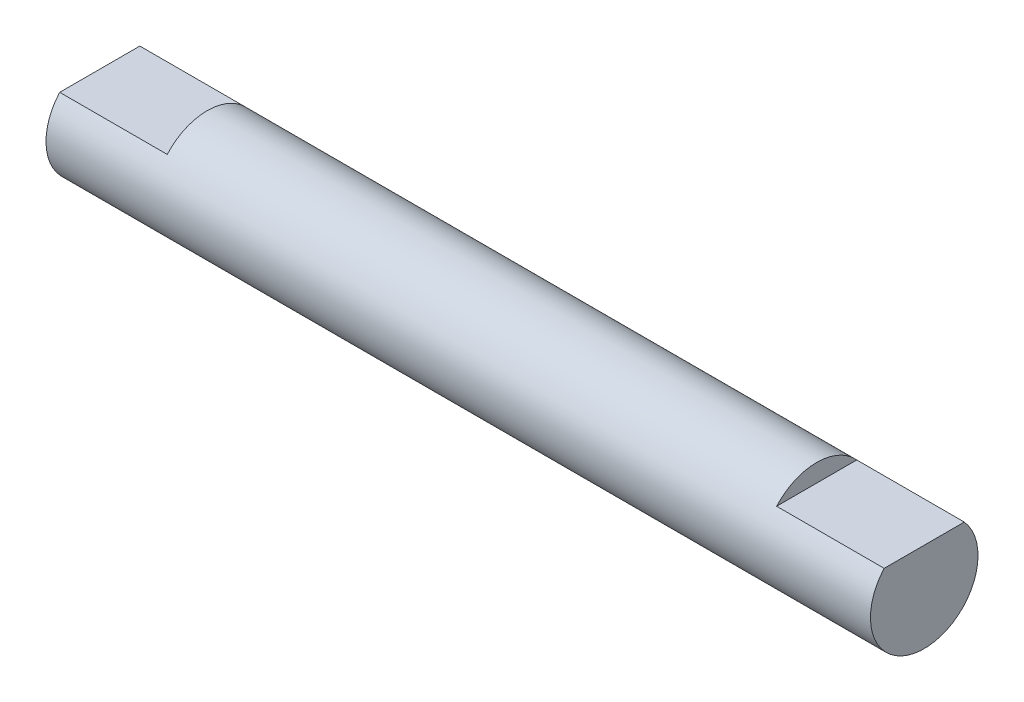
ISO-10303-21;
HEADER;
FILE_DESCRIPTION(('STEP AP214'),'2;1');
FILE_NAME('part.step','',(''),(''),'','','');
FILE_SCHEMA(('AUTOMOTIVE_DESIGN { 1 0 10303 214 1 1 1 1 }'));
ENDSEC;
DATA;
#1=APPLICATION_CONTEXT('core data for automotive mechanical design processes');
#2=APPLICATION_PROTOCOL_DEFINITION('international standard','automotive_design',2000,#1);
#3=PRODUCT_CONTEXT('',#1,'mechanical');
#4=PRODUCT('Part','Part','',(#3));
#5=PRODUCT_RELATED_PRODUCT_CATEGORY('part','',(#4));
#6=PRODUCT_DEFINITION_FORMATION('','',#4);
#7=PRODUCT_DEFINITION_CONTEXT('part definition',#1,'design');
#8=PRODUCT_DEFINITION('design','',#6,#7);
#9=PRODUCT_DEFINITION_SHAPE('','',#8);
#10=(LENGTH_UNIT() NAMED_UNIT(*) SI_UNIT(.MILLI.,.METRE.));
#11=(NAMED_UNIT(*) PLANE_ANGLE_UNIT() SI_UNIT($,.RADIAN.));
#12=(NAMED_UNIT(*) SI_UNIT($,.STERADIAN.) SOLID_ANGLE_UNIT());
#13=UNCERTAINTY_MEASURE_WITH_UNIT(LENGTH_MEASURE(1.E-05),#10,'distance_accuracy_value','');
#14=(GEOMETRIC_REPRESENTATION_CONTEXT(3) GLOBAL_UNCERTAINTY_ASSIGNED_CONTEXT((#13)) GLOBAL_UNIT_ASSIGNED_CONTEXT((#10,
#11,#12)) REPRESENTATION_CONTEXT('',''));
#15=CARTESIAN_POINT('',(0.,0.,0.));
#16=DIRECTION('',(0.,0.,1.));
#17=DIRECTION('',(1.,0.,0.));
#18=AXIS2_PLACEMENT_3D('',#15,#16,#17);
#19=CARTESIAN_POINT('',(0.,-2.99999999999999,0.));
#20=DIRECTION('',(-1.,0.,0.));
#21=DIRECTION('',(0.,0.,1.));
#22=AXIS2_PLACEMENT_3D('',#19,#20,#21);
#23=PLANE('',#22);
#24=DIRECTION('',(0.,0.,1.));
#25=VECTOR('',#24,1.);
#26=CARTESIAN_POINT('',(0.,2.,-2.23606797749979));
#27=LINE('',#26,#25);
#28=CARTESIAN_POINT('',(0.,2.,-2.23606797749979));
#29=VERTEX_POINT('',#28);
#30=CARTESIAN_POINT('',(0.,2.,2.23606797749979));
#31=VERTEX_POINT('',#30);
#32=EDGE_CURVE('E82',#29,#31,#27,.T.);
#33=ORIENTED_EDGE('',*,*,#32,.F.);
#34=CARTESIAN_POINT('',(0.,0.,0.));
#35=DIRECTION('',(-1.,0.,0.));
#36=DIRECTION('',(0.,0.,1.));
#37=AXIS2_PLACEMENT_3D('',#34,#35,#36);
#38=CIRCLE('',#37,2.99999999999999);
#39=EDGE_CURVE('E46',#29,#31,#38,.T.);
#40=ORIENTED_EDGE('',*,*,#39,.T.);
#41=EDGE_LOOP('',(#33,#40));
#42=FACE_BOUND('',#41,.T.);
#43=ADVANCED_FACE('F39',(#42),#23,.T.);
#44=CARTESIAN_POINT('',(46.,0.,0.));
#45=DIRECTION('',(1.,0.,0.));
#46=DIRECTION('',(0.,0.,-1.));
#47=AXIS2_PLACEMENT_3D('',#44,#45,#46);
#48=PLANE('',#47);
#49=DIRECTION('',(0.,0.,-1.));
#50=VECTOR('',#49,1.);
#51=CARTESIAN_POINT('',(46.,2.,2.23606797749979));
#52=LINE('',#51,#50);
#53=CARTESIAN_POINT('',(46.,2.,2.23606797749979));
#54=VERTEX_POINT('',#53);
#55=CARTESIAN_POINT('',(46.,2.,-2.23606797749979));
#56=VERTEX_POINT('',#55);
#57=EDGE_CURVE('E95',#54,#56,#52,.T.);
#58=ORIENTED_EDGE('',*,*,#57,.F.);
#59=CARTESIAN_POINT('',(46.,0.,0.));
#60=DIRECTION('',(-1.,0.,0.));
#61=DIRECTION('',(0.,0.,1.));
#62=AXIS2_PLACEMENT_3D('',#59,#60,#61);
#63=CIRCLE('',#62,3.);
#64=EDGE_CURVE('E11',#56,#54,#63,.T.);
#65=ORIENTED_EDGE('',*,*,#64,.F.);
#66=EDGE_LOOP('',(#58,#65));
#67=FACE_BOUND('',#66,.T.);
#68=ADVANCED_FACE('F109',(#67),#48,.T.);
#69=CARTESIAN_POINT('',(0.,0.,0.));
#70=DIRECTION('',(-1.,0.,0.));
#71=DIRECTION('',(0.,0.,1.));
#72=AXIS2_PLACEMENT_3D('',#69,#70,#71);
#73=CYLINDRICAL_SURFACE('',#72,3.);
#74=DIRECTION('',(-1.,0.,0.));
#75=VECTOR('',#74,1.);
#76=CARTESIAN_POINT('',(6.,2.,2.23606797749979));
#77=LINE('',#76,#75);
#78=CARTESIAN_POINT('',(6.,2.,2.23606797749979));
#79=VERTEX_POINT('',#78);
#80=EDGE_CURVE('E88',#79,#31,#77,.T.);
#81=ORIENTED_EDGE('',*,*,#80,.T.);
#82=ORIENTED_EDGE('',*,*,#39,.F.);
#83=DIRECTION('',(-1.,0.,0.));
#84=VECTOR('',#83,1.);
#85=CARTESIAN_POINT('',(6.,2.,-2.23606797749979));
#86=LINE('',#85,#84);
#87=CARTESIAN_POINT('',(6.,2.,-2.23606797749979));
#88=VERTEX_POINT('',#87);
#89=EDGE_CURVE('E86',#88,#29,#86,.T.);
#90=ORIENTED_EDGE('',*,*,#89,.F.);
#91=CARTESIAN_POINT('',(6.,0.,0.));
#92=DIRECTION('',(-1.,0.,0.));
#93=DIRECTION('',(0.,0.,1.));
#94=AXIS2_PLACEMENT_3D('',#91,#92,#93);
#95=CIRCLE('',#94,3.);
#96=EDGE_CURVE('E77',#79,#88,#95,.T.);
#97=ORIENTED_EDGE('',*,*,#96,.F.);
#98=EDGE_LOOP('',(#81,#82,#90,#97));
#99=FACE_BOUND('',#98,.T.);
#100=DIRECTION('',(1.,0.,0.));
#101=VECTOR('',#100,1.);
#102=CARTESIAN_POINT('',(40.,2.,2.23606797749979));
#103=LINE('',#102,#101);
#104=CARTESIAN_POINT('',(40.,2.,2.23606797749979));
#105=VERTEX_POINT('',#104);
#106=EDGE_CURVE('E102',#105,#54,#103,.T.);
#107=ORIENTED_EDGE('',*,*,#106,.F.);
#108=CARTESIAN_POINT('',(40.,0.,0.));
#109=DIRECTION('',(1.,0.,0.));
#110=DIRECTION('',(0.,0.,-1.));
#111=AXIS2_PLACEMENT_3D('',#108,#109,#110);
#112=CIRCLE('',#111,3.);
#113=CARTESIAN_POINT('',(40.,2.,-2.23606797749979));
#114=VERTEX_POINT('',#113);
#115=EDGE_CURVE('E99',#114,#105,#112,.T.);
#116=ORIENTED_EDGE('',*,*,#115,.F.);
#117=DIRECTION('',(1.,0.,0.));
#118=VECTOR('',#117,1.);
#119=CARTESIAN_POINT('',(40.,2.,-2.23606797749979));
#120=LINE('',#119,#118);
#121=EDGE_CURVE('E104',#114,#56,#120,.T.);
#122=ORIENTED_EDGE('',*,*,#121,.T.);
#123=ORIENTED_EDGE('',*,*,#64,.T.);
#124=EDGE_LOOP('',(#107,#116,#122,#123));
#125=FACE_BOUND('',#124,.T.);
#126=ADVANCED_FACE('F91',(#99,#125),#73,.T.);
#127=CARTESIAN_POINT('',(40.,2.,2.23606797749979));
#128=DIRECTION('',(0.,-1.,0.));
#129=DIRECTION('',(0.,0.,-1.));
#130=AXIS2_PLACEMENT_3D('',#127,#128,#129);
#131=PLANE('',#130);
#132=ORIENTED_EDGE('',*,*,#57,.T.);
#133=ORIENTED_EDGE('',*,*,#121,.F.);
#134=DIRECTION('',(0.,0.,-1.));
#135=VECTOR('',#134,1.);
#136=CARTESIAN_POINT('',(40.,2.,2.23606797749979));
#137=LINE('',#136,#135);
#138=EDGE_CURVE('E59',#105,#114,#137,.T.);
#139=ORIENTED_EDGE('',*,*,#138,.F.);
#140=ORIENTED_EDGE('',*,*,#106,.T.);
#141=EDGE_LOOP('',(#132,#133,#139,#140));
#142=FACE_BOUND('',#141,.T.);
#143=ADVANCED_FACE('F119',(#142),#131,.F.);
#144=CARTESIAN_POINT('',(40.,0.,0.));
#145=DIRECTION('',(1.,0.,0.));
#146=DIRECTION('',(0.,0.,-1.));
#147=AXIS2_PLACEMENT_3D('',#144,#145,#146);
#148=PLANE('',#147);
#149=ORIENTED_EDGE('',*,*,#115,.T.);
#150=ORIENTED_EDGE('',*,*,#138,.T.);
#151=EDGE_LOOP('',(#149,#150));
#152=FACE_BOUND('',#151,.T.);
#153=ADVANCED_FACE('F124',(#152),#148,.T.);
#154=CARTESIAN_POINT('',(6.,2.,-2.23606797749979));
#155=DIRECTION('',(0.,-1.,0.));
#156=DIRECTION('',(0.,0.,-1.));
#157=AXIS2_PLACEMENT_3D('',#154,#155,#156);
#158=PLANE('',#157);
#159=ORIENTED_EDGE('',*,*,#32,.T.);
#160=ORIENTED_EDGE('',*,*,#80,.F.);
#161=DIRECTION('',(0.,0.,1.));
#162=VECTOR('',#161,1.);
#163=CARTESIAN_POINT('',(6.,2.,-2.23606797749979));
#164=LINE('',#163,#162);
#165=EDGE_CURVE('E52',#88,#79,#164,.T.);
#166=ORIENTED_EDGE('',*,*,#165,.F.);
#167=ORIENTED_EDGE('',*,*,#89,.T.);
#168=EDGE_LOOP('',(#159,#160,#166,#167));
#169=FACE_BOUND('',#168,.T.);
#170=ADVANCED_FACE('F85',(#169),#158,.F.);
#171=CARTESIAN_POINT('',(6.,0.,0.));
#172=DIRECTION('',(-1.,0.,0.));
#173=DIRECTION('',(0.,0.,1.));
#174=AXIS2_PLACEMENT_3D('',#171,#172,#173);
#175=PLANE('',#174);
#176=ORIENTED_EDGE('',*,*,#96,.T.);
#177=ORIENTED_EDGE('',*,*,#165,.T.);
#178=EDGE_LOOP('',(#176,#177));
#179=FACE_BOUND('',#178,.T.);
#180=ADVANCED_FACE('F78',(#179),#175,.T.);
#181=CLOSED_SHELL('',(#43,#68,#126,#143,#153,#170,#180));
#182=MANIFOLD_SOLID_BREP('B2',#181);
#183=ADVANCED_BREP_SHAPE_REPRESENTATION('',(#18,#182),#14);
#184=SHAPE_DEFINITION_REPRESENTATION(#9,#183);
ENDSEC;
END-ISO-10303-21;
